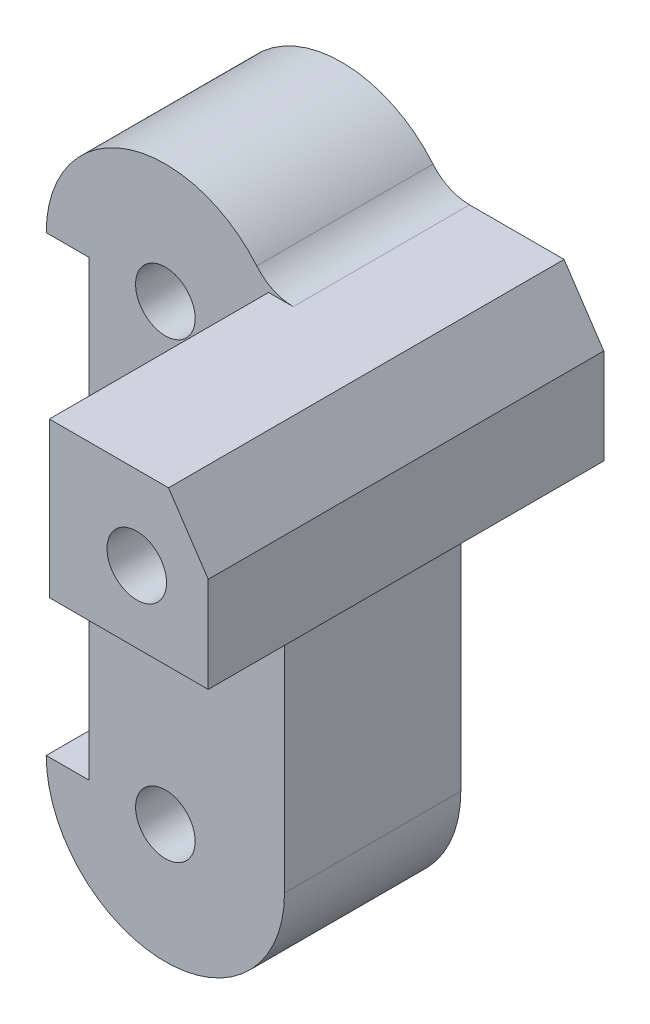
ISO-10303-21;
HEADER;
FILE_DESCRIPTION(('STEP AP214'),'2;1');
FILE_NAME('part.step','',(''),(''),'','','');
FILE_SCHEMA(('AUTOMOTIVE_DESIGN { 1 0 10303 214 1 1 1 1 }'));
ENDSEC;
DATA;
#1=APPLICATION_CONTEXT('core data for automotive mechanical design processes');
#2=APPLICATION_PROTOCOL_DEFINITION('international standard','automotive_design',2000,#1);
#3=PRODUCT_CONTEXT('',#1,'mechanical');
#4=PRODUCT('Part','Part','',(#3));
#5=PRODUCT_RELATED_PRODUCT_CATEGORY('part','',(#4));
#6=PRODUCT_DEFINITION_FORMATION('','',#4);
#7=PRODUCT_DEFINITION_CONTEXT('part definition',#1,'design');
#8=PRODUCT_DEFINITION('design','',#6,#7);
#9=PRODUCT_DEFINITION_SHAPE('','',#8);
#10=(LENGTH_UNIT() NAMED_UNIT(*) SI_UNIT(.MILLI.,.METRE.));
#11=(NAMED_UNIT(*) PLANE_ANGLE_UNIT() SI_UNIT($,.RADIAN.));
#12=(NAMED_UNIT(*) SI_UNIT($,.STERADIAN.) SOLID_ANGLE_UNIT());
#13=UNCERTAINTY_MEASURE_WITH_UNIT(LENGTH_MEASURE(1.E-05),#10,'distance_accuracy_value','');
#14=(GEOMETRIC_REPRESENTATION_CONTEXT(3) GLOBAL_UNCERTAINTY_ASSIGNED_CONTEXT((#13)) GLOBAL_UNIT_ASSIGNED_CONTEXT((#10,
#11,#12)) REPRESENTATION_CONTEXT('',''));
#15=CARTESIAN_POINT('',(0.,0.,0.));
#16=DIRECTION('',(0.,0.,1.));
#17=DIRECTION('',(1.,0.,0.));
#18=AXIS2_PLACEMENT_3D('',#15,#16,#17);
#19=CARTESIAN_POINT('',(-3.2,19.,7.4));
#20=DIRECTION('',(1.,0.,0.));
#21=DIRECTION('',(0.,1.,0.));
#22=AXIS2_PLACEMENT_3D('',#19,#20,#21);
#23=PLANE('',#22);
#24=CARTESIAN_POINT('',(-3.2,5.,4.4));
#25=DIRECTION('',(-1.,0.,0.));
#26=DIRECTION('',(0.,0.,1.));
#27=AXIS2_PLACEMENT_3D('',#24,#25,#26);
#28=CIRCLE('',#27,1.24999999999999);
#29=CARTESIAN_POINT('',(-3.2,5.,5.64999999999999));
#30=VERTEX_POINT('',#29);
#31=EDGE_CURVE('E274',#30,#30,#28,.T.);
#32=ORIENTED_EDGE('',*,*,#31,.F.);
#33=EDGE_LOOP('',(#32));
#34=FACE_BOUND('',#33,.T.);
#35=CARTESIAN_POINT('',(-3.2,15.,4.4));
#36=DIRECTION('',(-1.,0.,0.));
#37=DIRECTION('',(0.,0.,1.));
#38=AXIS2_PLACEMENT_3D('',#35,#36,#37);
#39=CIRCLE('',#38,1.24999999999999);
#40=CARTESIAN_POINT('',(-3.2,15.,5.64999999999999));
#41=VERTEX_POINT('',#40);
#42=EDGE_CURVE('E280',#41,#41,#39,.T.);
#43=ORIENTED_EDGE('',*,*,#42,.F.);
#44=EDGE_LOOP('',(#43));
#45=FACE_BOUND('',#44,.T.);
#46=DIRECTION('',(0.,0.,1.));
#47=VECTOR('',#46,1.);
#48=CARTESIAN_POINT('',(-3.2,8.5,4.57157287525381));
#49=LINE('',#48,#47);
#50=CARTESIAN_POINT('',(-3.2,8.5,4.57157287525381));
#51=VERTEX_POINT('',#50);
#52=CARTESIAN_POINT('',(-3.2,8.5,7.4));
#53=VERTEX_POINT('',#52);
#54=EDGE_CURVE('E160',#51,#53,#49,.T.);
#55=ORIENTED_EDGE('',*,*,#54,.F.);
#56=DIRECTION('',(0.,1.,0.));
#57=VECTOR('',#56,1.);
#58=CARTESIAN_POINT('',(-3.2,8.5,4.57157287525381));
#59=LINE('',#58,#57);
#60=CARTESIAN_POINT('',(-3.2,13.5,4.57157287525381));
#61=VERTEX_POINT('',#60);
#62=EDGE_CURVE('E295',#51,#61,#59,.T.);
#63=ORIENTED_EDGE('',*,*,#62,.T.);
#64=DIRECTION('',(0.,0.,1.));
#65=VECTOR('',#64,1.);
#66=CARTESIAN_POINT('',(-3.2,13.5,4.57157287525381));
#67=LINE('',#66,#65);
#68=CARTESIAN_POINT('',(-3.2,13.5,7.4));
#69=VERTEX_POINT('',#68);
#70=EDGE_CURVE('E301',#61,#69,#67,.T.);
#71=ORIENTED_EDGE('',*,*,#70,.T.);
#72=DIRECTION('',(0.,-1.,0.));
#73=VECTOR('',#72,1.);
#74=CARTESIAN_POINT('',(-3.2,19.,7.4));
#75=LINE('',#74,#73);
#76=CARTESIAN_POINT('',(-3.2,19.,7.4));
#77=VERTEX_POINT('',#76);
#78=EDGE_CURVE('E180',#77,#69,#75,.T.);
#79=ORIENTED_EDGE('',*,*,#78,.F.);
#80=DIRECTION('',(0.,0.,-1.));
#81=VECTOR('',#80,1.);
#82=CARTESIAN_POINT('',(-3.2,19.,7.4));
#83=LINE('',#82,#81);
#84=CARTESIAN_POINT('',(-3.2,19.,0.));
#85=VERTEX_POINT('',#84);
#86=EDGE_CURVE('E239',#77,#85,#83,.T.);
#87=ORIENTED_EDGE('',*,*,#86,.T.);
#88=DIRECTION('',(0.,-1.,0.));
#89=VECTOR('',#88,1.);
#90=CARTESIAN_POINT('',(-3.2,19.,0.));
#91=LINE('',#90,#89);
#92=CARTESIAN_POINT('',(-3.2,0.,0.));
#93=VERTEX_POINT('',#92);
#94=EDGE_CURVE('E200',#85,#93,#91,.T.);
#95=ORIENTED_EDGE('',*,*,#94,.T.);
#96=DIRECTION('',(0.,0.,-1.));
#97=VECTOR('',#96,1.);
#98=CARTESIAN_POINT('',(-3.2,0.,7.4));
#99=LINE('',#98,#97);
#100=CARTESIAN_POINT('',(-3.2,0.,7.4));
#101=VERTEX_POINT('',#100);
#102=EDGE_CURVE('E178',#101,#93,#99,.T.);
#103=ORIENTED_EDGE('',*,*,#102,.F.);
#104=EDGE_CURVE('E172',#53,#101,#75,.T.);
#105=ORIENTED_EDGE('',*,*,#104,.F.);
#106=EDGE_LOOP('',(#55,#63,#71,#79,#87,#95,#103,#105));
#107=FACE_BOUND('',#106,.T.);
#108=ADVANCED_FACE('F41',(#34,#45,#107),#23,.F.);
#109=CARTESIAN_POINT('',(0.,19.,7.4));
#110=DIRECTION('',(0.,0.,1.));
#111=DIRECTION('',(1.,0.,0.));
#112=AXIS2_PLACEMENT_3D('',#109,#110,#111);
#113=PLANE('',#112);
#114=CARTESIAN_POINT('',(0.,19.,7.4));
#115=DIRECTION('',(0.,0.,1.));
#116=DIRECTION('',(1.,0.,0.));
#117=AXIS2_PLACEMENT_3D('',#114,#115,#116);
#118=CIRCLE('',#117,1.24999999999999);
#119=CARTESIAN_POINT('',(1.24999999999999,19.,7.4));
#120=VERTEX_POINT('',#119);
#121=EDGE_CURVE('E286',#120,#120,#118,.T.);
#122=ORIENTED_EDGE('',*,*,#121,.F.);
#123=EDGE_LOOP('',(#122));
#124=FACE_BOUND('',#123,.T.);
#125=CARTESIAN_POINT('',(0.,0.,7.4));
#126=DIRECTION('',(0.,0.,1.));
#127=DIRECTION('',(1.,0.,0.));
#128=AXIS2_PLACEMENT_3D('',#125,#126,#127);
#129=CIRCLE('',#128,1.24999999999999);
#130=CARTESIAN_POINT('',(1.24999999999999,0.,7.4));
#131=VERTEX_POINT('',#130);
#132=EDGE_CURVE('E292',#131,#131,#129,.T.);
#133=ORIENTED_EDGE('',*,*,#132,.F.);
#134=EDGE_LOOP('',(#133));
#135=FACE_BOUND('',#134,.T.);
#136=DIRECTION('',(0.,1.,0.));
#137=VECTOR('',#136,1.);
#138=CARTESIAN_POINT('',(-0.37157287525381,8.5,7.4));
#139=LINE('',#138,#137);
#140=CARTESIAN_POINT('',(-0.37157287525381,8.5,7.4));
#141=VERTEX_POINT('',#140);
#142=CARTESIAN_POINT('',(-0.37157287525381,13.5,7.4));
#143=VERTEX_POINT('',#142);
#144=EDGE_CURVE('E175',#141,#143,#139,.T.);
#145=ORIENTED_EDGE('',*,*,#144,.F.);
#146=DIRECTION('',(1.,0.,0.));
#147=VECTOR('',#146,1.);
#148=CARTESIAN_POINT('',(-3.2,8.5,7.4));
#149=LINE('',#148,#147);
#150=EDGE_CURVE('E163',#53,#141,#149,.T.);
#151=ORIENTED_EDGE('',*,*,#150,.F.);
#152=ORIENTED_EDGE('',*,*,#104,.T.);
#153=DIRECTION('',(-1.,0.,0.));
#154=VECTOR('',#153,1.);
#155=CARTESIAN_POINT('',(-3.2,0.,7.4));
#156=LINE('',#155,#154);
#157=CARTESIAN_POINT('',(-5.,0.,7.4));
#158=VERTEX_POINT('',#157);
#159=EDGE_CURVE('E184',#101,#158,#156,.T.);
#160=ORIENTED_EDGE('',*,*,#159,.T.);
#161=CARTESIAN_POINT('',(0.,0.,7.4));
#162=DIRECTION('',(0.,0.,1.));
#163=DIRECTION('',(1.,0.,0.));
#164=AXIS2_PLACEMENT_3D('',#161,#162,#163);
#165=CIRCLE('',#164,5.);
#166=CARTESIAN_POINT('',(5.,0.,7.4));
#167=VERTEX_POINT('',#166);
#168=EDGE_CURVE('E191',#158,#167,#165,.T.);
#169=ORIENTED_EDGE('',*,*,#168,.T.);
#170=DIRECTION('',(0.,1.,0.));
#171=VECTOR('',#170,1.);
#172=CARTESIAN_POINT('',(5.,4.,7.4));
#173=LINE('',#172,#171);
#174=CARTESIAN_POINT('',(5.,15.,7.4));
#175=VERTEX_POINT('',#174);
#176=EDGE_CURVE('E193',#167,#175,#173,.T.);
#177=ORIENTED_EDGE('',*,*,#176,.T.);
#178=DIRECTION('',(1.,0.,0.));
#179=VECTOR('',#178,1.);
#180=CARTESIAN_POINT('',(0.,15.,7.4));
#181=LINE('',#180,#179);
#182=CARTESIAN_POINT('',(4.33333333333333,15.,7.4));
#183=VERTEX_POINT('',#182);
#184=EDGE_CURVE('E246',#183,#175,#181,.T.);
#185=ORIENTED_EDGE('',*,*,#184,.F.);
#186=DIRECTION('',(0.,-1.,0.));
#187=VECTOR('',#186,1.);
#188=CARTESIAN_POINT('',(4.33333333333333,0.,7.4));
#189=LINE('',#188,#187);
#190=CARTESIAN_POINT('',(4.33333333333333,21.4944382578493,7.4));
#191=VERTEX_POINT('',#190);
#192=EDGE_CURVE('E250',#191,#183,#189,.T.);
#193=ORIENTED_EDGE('',*,*,#192,.F.);
#194=DIRECTION('',(-1.,0.,0.));
#195=VECTOR('',#194,1.);
#196=CARTESIAN_POINT('',(4.33333333333333,21.4944382578493,7.4));
#197=LINE('',#196,#195);
#198=CARTESIAN_POINT('',(5.36656545160688,21.4944382578493,7.4));
#199=VERTEX_POINT('',#198);
#200=EDGE_CURVE('E64',#199,#191,#197,.T.);
#201=ORIENTED_EDGE('',*,*,#200,.F.);
#202=CARTESIAN_POINT('',(5.36656545160688,23.4944382578493,7.4));
#203=DIRECTION('',(0.,0.,1.));
#204=DIRECTION('',(1.,0.,0.));
#205=AXIS2_PLACEMENT_3D('',#202,#203,#204);
#206=CIRCLE('',#205,2.);
#207=CARTESIAN_POINT('',(3.83326103686206,22.2103130413209,7.4));
#208=VERTEX_POINT('',#207);
#209=EDGE_CURVE('E11',#199,#208,#206,.F.);
#210=ORIENTED_EDGE('',*,*,#209,.T.);
#211=CARTESIAN_POINT('',(0.,19.,7.4));
#212=DIRECTION('',(0.,0.,1.));
#213=DIRECTION('',(1.,0.,0.));
#214=AXIS2_PLACEMENT_3D('',#211,#212,#213);
#215=CIRCLE('',#214,5.);
#216=CARTESIAN_POINT('',(-5.,19.,7.4));
#217=VERTEX_POINT('',#216);
#218=EDGE_CURVE('E194',#208,#217,#215,.T.);
#219=ORIENTED_EDGE('',*,*,#218,.T.);
#220=DIRECTION('',(1.,0.,0.));
#221=VECTOR('',#220,1.);
#222=CARTESIAN_POINT('',(-3.2,19.,7.4));
#223=LINE('',#222,#221);
#224=EDGE_CURVE('E181',#217,#77,#223,.T.);
#225=ORIENTED_EDGE('',*,*,#224,.T.);
#226=ORIENTED_EDGE('',*,*,#78,.T.);
#227=DIRECTION('',(1.,0.,0.));
#228=VECTOR('',#227,1.);
#229=CARTESIAN_POINT('',(-3.2,13.5,7.4));
#230=LINE('',#229,#228);
#231=EDGE_CURVE('E299',#69,#143,#230,.T.);
#232=ORIENTED_EDGE('',*,*,#231,.T.);
#233=EDGE_LOOP('',(#145,#151,#152,#160,#169,#177,#185,#193,#201,#210,#219,#225,#226,#232));
#234=FACE_BOUND('',#233,.T.);
#235=ADVANCED_FACE('F171',(#124,#135,#234),#113,.T.);
#236=CARTESIAN_POINT('',(-3.2,19.,7.4));
#237=DIRECTION('',(0.,1.,0.));
#238=DIRECTION('',(0.,0.,1.));
#239=AXIS2_PLACEMENT_3D('',#236,#237,#238);
#240=PLANE('',#239);
#241=DIRECTION('',(1.,0.,0.));
#242=VECTOR('',#241,1.);
#243=CARTESIAN_POINT('',(-3.2,19.,0.));
#244=LINE('',#243,#242);
#245=CARTESIAN_POINT('',(-5.,19.,0.));
#246=VERTEX_POINT('',#245);
#247=EDGE_CURVE('E197',#246,#85,#244,.T.);
#248=ORIENTED_EDGE('',*,*,#247,.T.);
#249=ORIENTED_EDGE('',*,*,#86,.F.);
#250=ORIENTED_EDGE('',*,*,#224,.F.);
#251=DIRECTION('',(0.,0.,-1.));
#252=VECTOR('',#251,1.);
#253=CARTESIAN_POINT('',(-5.,19.,7.4));
#254=LINE('',#253,#252);
#255=EDGE_CURVE('E196',#217,#246,#254,.T.);
#256=ORIENTED_EDGE('',*,*,#255,.T.);
#257=EDGE_LOOP('',(#248,#249,#250,#256));
#258=FACE_BOUND('',#257,.T.);
#259=ADVANCED_FACE('F330',(#258),#240,.F.);
#260=CARTESIAN_POINT('',(-3.2,0.,7.4));
#261=DIRECTION('',(0.,-1.,0.));
#262=DIRECTION('',(1.,0.,0.));
#263=AXIS2_PLACEMENT_3D('',#260,#261,#262);
#264=PLANE('',#263);
#265=DIRECTION('',(-1.,0.,0.));
#266=VECTOR('',#265,1.);
#267=CARTESIAN_POINT('',(-3.2,0.,0.));
#268=LINE('',#267,#266);
#269=CARTESIAN_POINT('',(-5.,0.,0.));
#270=VERTEX_POINT('',#269);
#271=EDGE_CURVE('E203',#93,#270,#268,.T.);
#272=ORIENTED_EDGE('',*,*,#271,.T.);
#273=DIRECTION('',(0.,0.,-1.));
#274=VECTOR('',#273,1.);
#275=CARTESIAN_POINT('',(-5.,0.,7.4));
#276=LINE('',#275,#274);
#277=EDGE_CURVE('E235',#158,#270,#276,.T.);
#278=ORIENTED_EDGE('',*,*,#277,.F.);
#279=ORIENTED_EDGE('',*,*,#159,.F.);
#280=ORIENTED_EDGE('',*,*,#102,.T.);
#281=EDGE_LOOP('',(#272,#278,#279,#280));
#282=FACE_BOUND('',#281,.T.);
#283=ADVANCED_FACE('F336',(#282),#264,.F.);
#284=CARTESIAN_POINT('',(0.,0.,7.4));
#285=DIRECTION('',(0.,0.,-1.));
#286=DIRECTION('',(-1.,0.,0.));
#287=AXIS2_PLACEMENT_3D('',#284,#285,#286);
#288=CYLINDRICAL_SURFACE('',#287,5.);
#289=CARTESIAN_POINT('',(0.,0.,0.));
#290=DIRECTION('',(0.,0.,1.));
#291=DIRECTION('',(1.,0.,0.));
#292=AXIS2_PLACEMENT_3D('',#289,#290,#291);
#293=CIRCLE('',#292,5.);
#294=CARTESIAN_POINT('',(5.,0.,0.));
#295=VERTEX_POINT('',#294);
#296=EDGE_CURVE('E205',#270,#295,#293,.T.);
#297=ORIENTED_EDGE('',*,*,#296,.T.);
#298=DIRECTION('',(0.,0.,-1.));
#299=VECTOR('',#298,1.);
#300=CARTESIAN_POINT('',(5.,0.,7.4));
#301=LINE('',#300,#299);
#302=EDGE_CURVE('E232',#167,#295,#301,.T.);
#303=ORIENTED_EDGE('',*,*,#302,.F.);
#304=ORIENTED_EDGE('',*,*,#168,.F.);
#305=ORIENTED_EDGE('',*,*,#277,.T.);
#306=EDGE_LOOP('',(#297,#303,#304,#305));
#307=FACE_BOUND('',#306,.T.);
#308=ADVANCED_FACE('F343',(#307),#288,.T.);
#309=CARTESIAN_POINT('',(5.,4.,7.4));
#310=DIRECTION('',(-1.,0.,0.));
#311=DIRECTION('',(0.,0.,1.));
#312=AXIS2_PLACEMENT_3D('',#309,#310,#311);
#313=PLANE('',#312);
#314=DIRECTION('',(0.,1.,0.));
#315=VECTOR('',#314,1.);
#316=CARTESIAN_POINT('',(5.,4.,0.));
#317=LINE('',#316,#315);
#318=CARTESIAN_POINT('',(5.,15.,0.));
#319=VERTEX_POINT('',#318);
#320=EDGE_CURVE('E208',#295,#319,#317,.T.);
#321=ORIENTED_EDGE('',*,*,#320,.T.);
#322=DIRECTION('',(0.,0.,-1.));
#323=VECTOR('',#322,1.);
#324=CARTESIAN_POINT('',(5.,15.,7.4));
#325=LINE('',#324,#323);
#326=EDGE_CURVE('E231',#175,#319,#325,.T.);
#327=ORIENTED_EDGE('',*,*,#326,.F.);
#328=ORIENTED_EDGE('',*,*,#176,.F.);
#329=ORIENTED_EDGE('',*,*,#302,.T.);
#330=EDGE_LOOP('',(#321,#327,#328,#329));
#331=FACE_BOUND('',#330,.T.);
#332=ADVANCED_FACE('F434',(#331),#313,.F.);
#333=CARTESIAN_POINT('',(11.,15.,7.4));
#334=DIRECTION('',(0.,1.,0.));
#335=DIRECTION('',(0.,0.,1.));
#336=AXIS2_PLACEMENT_3D('',#333,#334,#335);
#337=PLANE('',#336);
#338=DIRECTION('',(1.,0.,0.));
#339=VECTOR('',#338,1.);
#340=CARTESIAN_POINT('',(11.,15.,0.));
#341=LINE('',#340,#339);
#342=CARTESIAN_POINT('',(11.,15.,0.));
#343=VERTEX_POINT('',#342);
#344=EDGE_CURVE('E210',#319,#343,#341,.T.);
#345=ORIENTED_EDGE('',*,*,#344,.T.);
#346=DIRECTION('',(0.,0.,-1.));
#347=VECTOR('',#346,1.);
#348=CARTESIAN_POINT('',(11.,15.,7.4));
#349=LINE('',#348,#347);
#350=CARTESIAN_POINT('',(11.,15.,16.6));
#351=VERTEX_POINT('',#350);
#352=EDGE_CURVE('E228',#351,#343,#349,.T.);
#353=ORIENTED_EDGE('',*,*,#352,.F.);
#354=DIRECTION('',(1.,0.,0.));
#355=VECTOR('',#354,1.);
#356=CARTESIAN_POINT('',(0.,15.,16.6));
#357=LINE('',#356,#355);
#358=CARTESIAN_POINT('',(4.33333333333333,15.,16.6));
#359=VERTEX_POINT('',#358);
#360=EDGE_CURVE('E267',#359,#351,#357,.T.);
#361=ORIENTED_EDGE('',*,*,#360,.F.);
#362=DIRECTION('',(0.,0.,-1.));
#363=VECTOR('',#362,1.);
#364=CARTESIAN_POINT('',(4.33333333333333,15.,16.6));
#365=LINE('',#364,#363);
#366=EDGE_CURVE('E201',#359,#183,#365,.T.);
#367=ORIENTED_EDGE('',*,*,#366,.T.);
#368=ORIENTED_EDGE('',*,*,#184,.T.);
#369=ORIENTED_EDGE('',*,*,#326,.T.);
#370=EDGE_LOOP('',(#345,#353,#361,#367,#368,#369));
#371=FACE_BOUND('',#370,.T.);
#372=ADVANCED_FACE('F430',(#371),#337,.F.);
#373=CARTESIAN_POINT('',(11.,19.,7.4));
#374=DIRECTION('',(-1.,0.,0.));
#375=DIRECTION('',(0.,0.,1.));
#376=AXIS2_PLACEMENT_3D('',#373,#374,#375);
#377=PLANE('',#376);
#378=DIRECTION('',(0.,1.,0.));
#379=VECTOR('',#378,1.);
#380=CARTESIAN_POINT('',(11.,19.,0.));
#381=LINE('',#380,#379);
#382=CARTESIAN_POINT('',(11.,19.,0.));
#383=VERTEX_POINT('',#382);
#384=EDGE_CURVE('E212',#343,#383,#381,.T.);
#385=ORIENTED_EDGE('',*,*,#384,.T.);
#386=DIRECTION('',(0.,0.,-1.));
#387=VECTOR('',#386,1.);
#388=CARTESIAN_POINT('',(11.,19.,7.4));
#389=LINE('',#388,#387);
#390=CARTESIAN_POINT('',(11.,19.,16.6));
#391=VERTEX_POINT('',#390);
#392=EDGE_CURVE('E225',#391,#383,#389,.T.);
#393=ORIENTED_EDGE('',*,*,#392,.F.);
#394=DIRECTION('',(0.,1.,0.));
#395=VECTOR('',#394,1.);
#396=CARTESIAN_POINT('',(11.,0.,16.6));
#397=LINE('',#396,#395);
#398=EDGE_CURVE('E264',#351,#391,#397,.T.);
#399=ORIENTED_EDGE('',*,*,#398,.F.);
#400=ORIENTED_EDGE('',*,*,#352,.T.);
#401=EDGE_LOOP('',(#385,#393,#399,#400));
#402=FACE_BOUND('',#401,.T.);
#403=ADVANCED_FACE('F426',(#402),#377,.F.);
#404=CARTESIAN_POINT('',(9.33333333333333,21.4944382578493,7.4));
#405=DIRECTION('',(-0.831479419283097,-0.555555555555557,0.));
#406=DIRECTION('',(0.555555555555557,-0.831479419283097,0.));
#407=AXIS2_PLACEMENT_3D('',#404,#405,#406);
#408=PLANE('',#407);
#409=DIRECTION('',(-0.555555555555557,0.831479419283097,0.));
#410=VECTOR('',#409,1.);
#411=CARTESIAN_POINT('',(9.33333333333333,21.4944382578493,0.));
#412=LINE('',#411,#410);
#413=CARTESIAN_POINT('',(9.33333333333333,21.4944382578493,0.));
#414=VERTEX_POINT('',#413);
#415=EDGE_CURVE('E214',#383,#414,#412,.T.);
#416=ORIENTED_EDGE('',*,*,#415,.T.);
#417=DIRECTION('',(0.,0.,-1.));
#418=VECTOR('',#417,1.);
#419=CARTESIAN_POINT('',(9.33333333333333,21.4944382578493,7.4));
#420=LINE('',#419,#418);
#421=CARTESIAN_POINT('',(9.33333333333333,21.4944382578493,16.6));
#422=VERTEX_POINT('',#421);
#423=EDGE_CURVE('E222',#422,#414,#420,.T.);
#424=ORIENTED_EDGE('',*,*,#423,.F.);
#425=DIRECTION('',(-0.555555555555557,0.831479419283097,0.));
#426=VECTOR('',#425,1.);
#427=CARTESIAN_POINT('',(16.3816654751488,10.9454606487054,16.6));
#428=LINE('',#427,#426);
#429=EDGE_CURVE('E261',#391,#422,#428,.T.);
#430=ORIENTED_EDGE('',*,*,#429,.F.);
#431=ORIENTED_EDGE('',*,*,#392,.T.);
#432=EDGE_LOOP('',(#416,#424,#430,#431));
#433=FACE_BOUND('',#432,.T.);
#434=ADVANCED_FACE('F423',(#433),#408,.F.);
#435=CARTESIAN_POINT('',(4.33333333333333,21.4944382578493,7.4));
#436=DIRECTION('',(0.,-1.,0.));
#437=DIRECTION('',(0.,0.,-1.));
#438=AXIS2_PLACEMENT_3D('',#435,#436,#437);
#439=PLANE('',#438);
#440=DIRECTION('',(-1.,0.,0.));
#441=VECTOR('',#440,1.);
#442=CARTESIAN_POINT('',(4.33333333333333,21.4944382578493,0.));
#443=LINE('',#442,#441);
#444=CARTESIAN_POINT('',(5.36656545160688,21.4944382578493,0.));
#445=VERTEX_POINT('',#444);
#446=EDGE_CURVE('E216',#414,#445,#443,.T.);
#447=ORIENTED_EDGE('',*,*,#446,.T.);
#448=DIRECTION('',(0.,0.,1.));
#449=VECTOR('',#448,1.);
#450=CARTESIAN_POINT('',(5.36656545160688,21.4944382578493,7.4));
#451=LINE('',#450,#449);
#452=EDGE_CURVE('E361',#445,#199,#451,.T.);
#453=ORIENTED_EDGE('',*,*,#452,.T.);
#454=ORIENTED_EDGE('',*,*,#200,.T.);
#455=DIRECTION('',(0.,0.,-1.));
#456=VECTOR('',#455,1.);
#457=CARTESIAN_POINT('',(4.33333333333333,21.4944382578493,16.6));
#458=LINE('',#457,#456);
#459=CARTESIAN_POINT('',(4.33333333333333,21.4944382578493,16.6));
#460=VERTEX_POINT('',#459);
#461=EDGE_CURVE('E253',#460,#191,#458,.T.);
#462=ORIENTED_EDGE('',*,*,#461,.F.);
#463=DIRECTION('',(-1.,0.,0.));
#464=VECTOR('',#463,1.);
#465=CARTESIAN_POINT('',(0.,21.4944382578493,16.6));
#466=LINE('',#465,#464);
#467=EDGE_CURVE('E256',#422,#460,#466,.T.);
#468=ORIENTED_EDGE('',*,*,#467,.F.);
#469=ORIENTED_EDGE('',*,*,#423,.T.);
#470=EDGE_LOOP('',(#447,#453,#454,#462,#468,#469));
#471=FACE_BOUND('',#470,.T.);
#472=ADVANCED_FACE('F372',(#471),#439,.F.);
#473=CARTESIAN_POINT('',(0.,19.,7.4));
#474=DIRECTION('',(0.,0.,-1.));
#475=DIRECTION('',(-1.,0.,0.));
#476=AXIS2_PLACEMENT_3D('',#473,#474,#475);
#477=CYLINDRICAL_SURFACE('',#476,5.);
#478=ORIENTED_EDGE('',*,*,#218,.F.);
#479=DIRECTION('',(0.,0.,-1.));
#480=VECTOR('',#479,1.);
#481=CARTESIAN_POINT('',(3.83326103686206,22.2103130413209,7.4));
#482=LINE('',#481,#480);
#483=CARTESIAN_POINT('',(3.83326103686206,22.2103130413209,0.));
#484=VERTEX_POINT('',#483);
#485=EDGE_CURVE('E242',#208,#484,#482,.T.);
#486=ORIENTED_EDGE('',*,*,#485,.T.);
#487=CARTESIAN_POINT('',(0.,19.,0.));
#488=DIRECTION('',(0.,0.,1.));
#489=DIRECTION('',(1.,0.,0.));
#490=AXIS2_PLACEMENT_3D('',#487,#488,#489);
#491=CIRCLE('',#490,5.);
#492=EDGE_CURVE('E186',#484,#246,#491,.T.);
#493=ORIENTED_EDGE('',*,*,#492,.T.);
#494=ORIENTED_EDGE('',*,*,#255,.F.);
#495=EDGE_LOOP('',(#478,#486,#493,#494));
#496=FACE_BOUND('',#495,.T.);
#497=ADVANCED_FACE('F358',(#496),#477,.T.);
#498=CARTESIAN_POINT('',(0.,19.,0.));
#499=DIRECTION('',(0.,0.,1.));
#500=DIRECTION('',(1.,0.,0.));
#501=AXIS2_PLACEMENT_3D('',#498,#499,#500);
#502=PLANE('',#501);
#503=CARTESIAN_POINT('',(8.,18.,0.));
#504=DIRECTION('',(0.,0.,1.));
#505=DIRECTION('',(1.,0.,0.));
#506=AXIS2_PLACEMENT_3D('',#503,#504,#505);
#507=CIRCLE('',#506,1.24999999999999);
#508=CARTESIAN_POINT('',(9.24999999999999,18.,0.));
#509=VERTEX_POINT('',#508);
#510=EDGE_CURVE('E45',#509,#509,#507,.T.);
#511=ORIENTED_EDGE('',*,*,#510,.T.);
#512=EDGE_LOOP('',(#511));
#513=FACE_BOUND('',#512,.T.);
#514=CARTESIAN_POINT('',(0.,0.,0.));
#515=DIRECTION('',(0.,0.,1.));
#516=DIRECTION('',(1.,0.,0.));
#517=AXIS2_PLACEMENT_3D('',#514,#515,#516);
#518=CIRCLE('',#517,1.24999999999999);
#519=CARTESIAN_POINT('',(1.24999999999999,0.,0.));
#520=VERTEX_POINT('',#519);
#521=EDGE_CURVE('E289',#520,#520,#518,.T.);
#522=ORIENTED_EDGE('',*,*,#521,.T.);
#523=EDGE_LOOP('',(#522));
#524=FACE_BOUND('',#523,.T.);
#525=CARTESIAN_POINT('',(0.,19.,0.));
#526=DIRECTION('',(0.,0.,1.));
#527=DIRECTION('',(1.,0.,0.));
#528=AXIS2_PLACEMENT_3D('',#525,#526,#527);
#529=CIRCLE('',#528,1.24999999999999);
#530=CARTESIAN_POINT('',(1.24999999999999,19.,0.));
#531=VERTEX_POINT('',#530);
#532=EDGE_CURVE('E283',#531,#531,#529,.T.);
#533=ORIENTED_EDGE('',*,*,#532,.T.);
#534=EDGE_LOOP('',(#533));
#535=FACE_BOUND('',#534,.T.);
#536=ORIENTED_EDGE('',*,*,#247,.F.);
#537=ORIENTED_EDGE('',*,*,#492,.F.);
#538=CARTESIAN_POINT('',(5.36656545160688,23.4944382578493,0.));
#539=DIRECTION('',(0.,0.,1.));
#540=DIRECTION('',(1.,0.,0.));
#541=AXIS2_PLACEMENT_3D('',#538,#539,#540);
#542=CIRCLE('',#541,2.);
#543=EDGE_CURVE('E50',#484,#445,#542,.T.);
#544=ORIENTED_EDGE('',*,*,#543,.T.);
#545=ORIENTED_EDGE('',*,*,#446,.F.);
#546=ORIENTED_EDGE('',*,*,#415,.F.);
#547=ORIENTED_EDGE('',*,*,#384,.F.);
#548=ORIENTED_EDGE('',*,*,#344,.F.);
#549=ORIENTED_EDGE('',*,*,#320,.F.);
#550=ORIENTED_EDGE('',*,*,#296,.F.);
#551=ORIENTED_EDGE('',*,*,#271,.F.);
#552=ORIENTED_EDGE('',*,*,#94,.F.);
#553=EDGE_LOOP('',(#536,#537,#544,#545,#546,#547,#548,#549,#550,#551,#552));
#554=FACE_BOUND('',#553,.T.);
#555=ADVANCED_FACE('F312',(#513,#524,#535,#554),#502,.F.);
#556=CARTESIAN_POINT('',(4.33333333333333,0.,16.6));
#557=DIRECTION('',(1.,0.,0.));
#558=DIRECTION('',(0.,1.,0.));
#559=AXIS2_PLACEMENT_3D('',#556,#557,#558);
#560=PLANE('',#559);
#561=ORIENTED_EDGE('',*,*,#192,.T.);
#562=ORIENTED_EDGE('',*,*,#366,.F.);
#563=DIRECTION('',(0.,-1.,0.));
#564=VECTOR('',#563,1.);
#565=CARTESIAN_POINT('',(4.33333333333333,0.,16.6));
#566=LINE('',#565,#564);
#567=EDGE_CURVE('E249',#460,#359,#566,.T.);
#568=ORIENTED_EDGE('',*,*,#567,.F.);
#569=ORIENTED_EDGE('',*,*,#461,.T.);
#570=EDGE_LOOP('',(#561,#562,#568,#569));
#571=FACE_BOUND('',#570,.T.);
#572=ADVANCED_FACE('F412',(#571),#560,.F.);
#573=CARTESIAN_POINT('',(0.,0.,16.6));
#574=DIRECTION('',(0.,0.,1.));
#575=DIRECTION('',(1.,0.,0.));
#576=AXIS2_PLACEMENT_3D('',#573,#574,#575);
#577=PLANE('',#576);
#578=CARTESIAN_POINT('',(8.,18.,16.6));
#579=DIRECTION('',(0.,0.,1.));
#580=DIRECTION('',(1.,0.,0.));
#581=AXIS2_PLACEMENT_3D('',#578,#579,#580);
#582=CIRCLE('',#581,1.24999999999999);
#583=CARTESIAN_POINT('',(9.24999999999999,18.,16.6));
#584=VERTEX_POINT('',#583);
#585=EDGE_CURVE('E305',#584,#584,#582,.T.);
#586=ORIENTED_EDGE('',*,*,#585,.F.);
#587=EDGE_LOOP('',(#586));
#588=FACE_BOUND('',#587,.T.);
#589=ORIENTED_EDGE('',*,*,#567,.T.);
#590=ORIENTED_EDGE('',*,*,#360,.T.);
#591=ORIENTED_EDGE('',*,*,#398,.T.);
#592=ORIENTED_EDGE('',*,*,#429,.T.);
#593=ORIENTED_EDGE('',*,*,#467,.T.);
#594=EDGE_LOOP('',(#589,#590,#591,#592,#593));
#595=FACE_BOUND('',#594,.T.);
#596=ADVANCED_FACE('F408',(#588,#595),#577,.T.);
#597=CARTESIAN_POINT('',(3.30000000000001,5.,4.4));
#598=DIRECTION('',(-1.,0.,0.));
#599=DIRECTION('',(0.,0.,1.));
#600=AXIS2_PLACEMENT_3D('',#597,#598,#599);
#601=CONICAL_SURFACE('',#600,1.24999999999999,1.02974425867665);
#602=CARTESIAN_POINT('',(4.05107577378445,5.,4.4));
#603=VERTEX_POINT('',#602);
#604=VERTEX_LOOP('',#603);
#605=FACE_BOUND('',#604,.T.);
#606=CARTESIAN_POINT('',(3.30000000000001,5.,4.4));
#607=DIRECTION('',(-1.,0.,0.));
#608=DIRECTION('',(0.,0.,1.));
#609=AXIS2_PLACEMENT_3D('',#606,#607,#608);
#610=CIRCLE('',#609,1.24999999999999);
#611=CARTESIAN_POINT('',(3.30000000000001,5.,5.64999999999999));
#612=VERTEX_POINT('',#611);
#613=EDGE_CURVE('E259',#612,#612,#610,.T.);
#614=ORIENTED_EDGE('',*,*,#613,.T.);
#615=EDGE_LOOP('',(#614));
#616=FACE_BOUND('',#615,.T.);
#617=ADVANCED_FACE('F404',(#605,#616),#601,.F.);
#618=CARTESIAN_POINT('',(-3.2,5.,4.4));
#619=DIRECTION('',(-1.,0.,0.));
#620=DIRECTION('',(0.,0.,1.));
#621=AXIS2_PLACEMENT_3D('',#618,#619,#620);
#622=CYLINDRICAL_SURFACE('',#621,1.24999999999999);
#623=ORIENTED_EDGE('',*,*,#613,.F.);
#624=EDGE_LOOP('',(#623));
#625=FACE_BOUND('',#624,.T.);
#626=ORIENTED_EDGE('',*,*,#31,.T.);
#627=EDGE_LOOP('',(#626));
#628=FACE_BOUND('',#627,.T.);
#629=ADVANCED_FACE('F400',(#625,#628),#622,.F.);
#630=CARTESIAN_POINT('',(3.3,15.,4.4));
#631=DIRECTION('',(-1.,0.,0.));
#632=DIRECTION('',(0.,0.,1.));
#633=AXIS2_PLACEMENT_3D('',#630,#631,#632);
#634=CONICAL_SURFACE('',#633,1.24999999999999,1.02974425867665);
#635=CARTESIAN_POINT('',(4.05107577378445,15.,4.4));
#636=VERTEX_POINT('',#635);
#637=VERTEX_LOOP('',#636);
#638=FACE_BOUND('',#637,.T.);
#639=CARTESIAN_POINT('',(3.3,15.,4.4));
#640=DIRECTION('',(-1.,0.,0.));
#641=DIRECTION('',(0.,0.,1.));
#642=AXIS2_PLACEMENT_3D('',#639,#640,#641);
#643=CIRCLE('',#642,1.24999999999999);
#644=CARTESIAN_POINT('',(3.3,15.,5.64999999999999));
#645=VERTEX_POINT('',#644);
#646=EDGE_CURVE('E277',#645,#645,#643,.T.);
#647=ORIENTED_EDGE('',*,*,#646,.T.);
#648=EDGE_LOOP('',(#647));
#649=FACE_BOUND('',#648,.T.);
#650=ADVANCED_FACE('F396',(#638,#649),#634,.F.);
#651=CARTESIAN_POINT('',(-3.2,15.,4.4));
#652=DIRECTION('',(-1.,0.,0.));
#653=DIRECTION('',(0.,0.,1.));
#654=AXIS2_PLACEMENT_3D('',#651,#652,#653);
#655=CYLINDRICAL_SURFACE('',#654,1.24999999999999);
#656=ORIENTED_EDGE('',*,*,#646,.F.);
#657=EDGE_LOOP('',(#656));
#658=FACE_BOUND('',#657,.T.);
#659=ORIENTED_EDGE('',*,*,#42,.T.);
#660=EDGE_LOOP('',(#659));
#661=FACE_BOUND('',#660,.T.);
#662=ADVANCED_FACE('F389',(#658,#661),#655,.F.);
#663=CARTESIAN_POINT('',(0.,19.,7.4));
#664=DIRECTION('',(0.,0.,1.));
#665=DIRECTION('',(1.,0.,0.));
#666=AXIS2_PLACEMENT_3D('',#663,#664,#665);
#667=CYLINDRICAL_SURFACE('',#666,1.24999999999999);
#668=ORIENTED_EDGE('',*,*,#121,.T.);
#669=EDGE_LOOP('',(#668));
#670=FACE_BOUND('',#669,.T.);
#671=ORIENTED_EDGE('',*,*,#532,.F.);
#672=EDGE_LOOP('',(#671));
#673=FACE_BOUND('',#672,.T.);
#674=ADVANCED_FACE('F383',(#670,#673),#667,.F.);
#675=CARTESIAN_POINT('',(0.,0.,7.4));
#676=DIRECTION('',(0.,0.,1.));
#677=DIRECTION('',(1.,0.,0.));
#678=AXIS2_PLACEMENT_3D('',#675,#676,#677);
#679=CYLINDRICAL_SURFACE('',#678,1.24999999999999);
#680=ORIENTED_EDGE('',*,*,#132,.T.);
#681=EDGE_LOOP('',(#680));
#682=FACE_BOUND('',#681,.T.);
#683=ORIENTED_EDGE('',*,*,#521,.F.);
#684=EDGE_LOOP('',(#683));
#685=FACE_BOUND('',#684,.T.);
#686=ADVANCED_FACE('F376',(#682,#685),#679,.F.);
#687=CARTESIAN_POINT('',(5.36656545160688,23.4944382578493,7.4));
#688=DIRECTION('',(0.,0.,-1.));
#689=DIRECTION('',(-1.,0.,0.));
#690=AXIS2_PLACEMENT_3D('',#687,#688,#689);
#691=CYLINDRICAL_SURFACE('',#690,2.);
#692=ORIENTED_EDGE('',*,*,#209,.F.);
#693=ORIENTED_EDGE('',*,*,#452,.F.);
#694=ORIENTED_EDGE('',*,*,#543,.F.);
#695=ORIENTED_EDGE('',*,*,#485,.F.);
#696=EDGE_LOOP('',(#692,#693,#694,#695));
#697=FACE_BOUND('',#696,.T.);
#698=ADVANCED_FACE('F43',(#697),#691,.F.);
#699=CARTESIAN_POINT('',(-0.37157287525381,8.5,7.4));
#700=DIRECTION('',(0.707106781186548,0.,-0.707106781186548));
#701=DIRECTION('',(-0.707106781186548,0.,-0.707106781186548));
#702=AXIS2_PLACEMENT_3D('',#699,#700,#701);
#703=PLANE('',#702);
#704=DIRECTION('',(-0.707106781186547,0.,-0.707106781186547));
#705=VECTOR('',#704,1.);
#706=CARTESIAN_POINT('',(-0.37157287525381,13.5,7.4));
#707=LINE('',#706,#705);
#708=EDGE_CURVE('E57',#143,#61,#707,.T.);
#709=ORIENTED_EDGE('',*,*,#708,.T.);
#710=ORIENTED_EDGE('',*,*,#62,.F.);
#711=DIRECTION('',(-0.707106781186547,0.,-0.707106781186547));
#712=VECTOR('',#711,1.);
#713=CARTESIAN_POINT('',(-0.37157287525381,8.5,7.4));
#714=LINE('',#713,#712);
#715=EDGE_CURVE('E165',#141,#51,#714,.T.);
#716=ORIENTED_EDGE('',*,*,#715,.F.);
#717=ORIENTED_EDGE('',*,*,#144,.T.);
#718=EDGE_LOOP('',(#709,#710,#716,#717));
#719=FACE_BOUND('',#718,.T.);
#720=ADVANCED_FACE('F375',(#719),#703,.F.);
#721=CARTESIAN_POINT('',(0.,8.5,0.));
#722=DIRECTION('',(0.,1.,0.));
#723=DIRECTION('',(0.,0.,1.));
#724=AXIS2_PLACEMENT_3D('',#721,#722,#723);
#725=PLANE('',#724);
#726=ORIENTED_EDGE('',*,*,#54,.T.);
#727=ORIENTED_EDGE('',*,*,#150,.T.);
#728=ORIENTED_EDGE('',*,*,#715,.T.);
#729=EDGE_LOOP('',(#726,#727,#728));
#730=FACE_BOUND('',#729,.T.);
#731=ADVANCED_FACE('F162',(#730),#725,.T.);
#732=CARTESIAN_POINT('',(0.,13.5,0.));
#733=DIRECTION('',(0.,1.,0.));
#734=DIRECTION('',(0.,0.,1.));
#735=AXIS2_PLACEMENT_3D('',#732,#733,#734);
#736=PLANE('',#735);
#737=ORIENTED_EDGE('',*,*,#70,.F.);
#738=ORIENTED_EDGE('',*,*,#708,.F.);
#739=ORIENTED_EDGE('',*,*,#231,.F.);
#740=EDGE_LOOP('',(#737,#738,#739));
#741=FACE_BOUND('',#740,.T.);
#742=ADVANCED_FACE('F317',(#741),#736,.F.);
#743=CARTESIAN_POINT('',(8.,18.,16.6));
#744=DIRECTION('',(0.,0.,1.));
#745=DIRECTION('',(1.,0.,0.));
#746=AXIS2_PLACEMENT_3D('',#743,#744,#745);
#747=CYLINDRICAL_SURFACE('',#746,1.24999999999999);
#748=ORIENTED_EDGE('',*,*,#585,.T.);
#749=EDGE_LOOP('',(#748));
#750=FACE_BOUND('',#749,.T.);
#751=ORIENTED_EDGE('',*,*,#510,.F.);
#752=EDGE_LOOP('',(#751));
#753=FACE_BOUND('',#752,.T.);
#754=ADVANCED_FACE('F315',(#750,#753),#747,.F.);
#755=CLOSED_SHELL('',(#108,#235,#259,#283,#308,#332,#372,#403,#434,#472,#497,#555,#572,#596,
#617,#629,#650,#662,#674,#686,#698,#720,#731,#742,#754));
#756=MANIFOLD_SOLID_BREP('B2',#755);
#757=ADVANCED_BREP_SHAPE_REPRESENTATION('',(#18,#756),#14);
#758=SHAPE_DEFINITION_REPRESENTATION(#9,#757);
ENDSEC;
END-ISO-10303-21;
